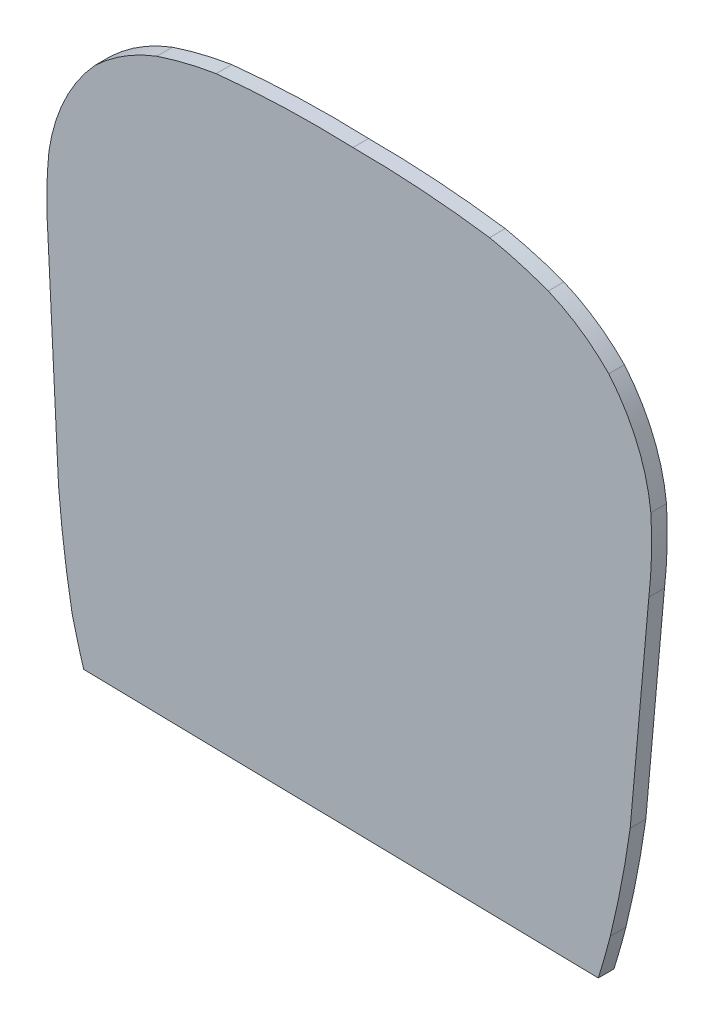
ISO-10303-21;
HEADER;
FILE_DESCRIPTION(('STEP AP214'),'2;1');
FILE_NAME('part.step','',(''),(''),'','','');
FILE_SCHEMA(('AUTOMOTIVE_DESIGN { 1 0 10303 214 1 1 1 1 }'));
ENDSEC;
DATA;
#1=APPLICATION_CONTEXT('core data for automotive mechanical design processes');
#2=APPLICATION_PROTOCOL_DEFINITION('international standard','automotive_design',2000,#1);
#3=PRODUCT_CONTEXT('',#1,'mechanical');
#4=PRODUCT('Part','Part','',(#3));
#5=PRODUCT_RELATED_PRODUCT_CATEGORY('part','',(#4));
#6=PRODUCT_DEFINITION_FORMATION('','',#4);
#7=PRODUCT_DEFINITION_CONTEXT('part definition',#1,'design');
#8=PRODUCT_DEFINITION('design','',#6,#7);
#9=PRODUCT_DEFINITION_SHAPE('','',#8);
#10=(LENGTH_UNIT() NAMED_UNIT(*) SI_UNIT(.MILLI.,.METRE.));
#11=(NAMED_UNIT(*) PLANE_ANGLE_UNIT() SI_UNIT($,.RADIAN.));
#12=(NAMED_UNIT(*) SI_UNIT($,.STERADIAN.) SOLID_ANGLE_UNIT());
#13=UNCERTAINTY_MEASURE_WITH_UNIT(LENGTH_MEASURE(1.E-05),#10,'distance_accuracy_value','');
#14=(GEOMETRIC_REPRESENTATION_CONTEXT(3) GLOBAL_UNCERTAINTY_ASSIGNED_CONTEXT((#13)) GLOBAL_UNIT_ASSIGNED_CONTEXT((#10,
#11,#12)) REPRESENTATION_CONTEXT('',''));
#15=CARTESIAN_POINT('',(0.,0.,0.));
#16=DIRECTION('',(0.,0.,1.));
#17=DIRECTION('',(1.,0.,0.));
#18=AXIS2_PLACEMENT_3D('',#15,#16,#17);
#19=CARTESIAN_POINT('',(-5.67417224383373,6.99934325123754,45.8150965279296));
#20=DIRECTION('',(0.,0.,1.));
#21=DIRECTION('',(-0.999812677663925,0.0193548335692306,0.));
#22=AXIS2_PLACEMENT_3D('',#19,#20,#21);
#23=PLANE('',#22);
#24=CARTESIAN_POINT('',(0.530056286970287,1.01824527478446,45.8150965279299));
#25=DIRECTION('',(0.,0.,-1.));
#26=DIRECTION('',(0.999812677663925,-0.0193548335692306,0.));
#27=AXIS2_PLACEMENT_3D('',#24,#25,#26);
#28=CIRCLE('',#27,12.0325225140272);
#29=CARTESIAN_POINT('',(2.90017532436274,12.8150301672525,45.8150965279298));
#30=VERTEX_POINT('',#29);
#31=CARTESIAN_POINT('',(4.78161682306448,12.2746137415013,45.8150965279299));
#32=VERTEX_POINT('',#31);
#33=EDGE_CURVE('E241',#30,#32,#28,.T.);
#34=ORIENTED_EDGE('',*,*,#33,.F.);
#35=CARTESIAN_POINT('',(-1.48641653317343,-17.9871033769043,45.8150965279301));
#36=DIRECTION('',(0.,0.,-1.));
#37=DIRECTION('',(0.999812677663925,-0.0193548335692306,0.));
#38=AXIS2_PLACEMENT_3D('',#35,#36,#37);
#39=CIRCLE('',#38,31.1129172370042);
#40=CARTESIAN_POINT('',(-1.47338446078643,13.1258111307685,45.8150965279297));
#41=VERTEX_POINT('',#40);
#42=EDGE_CURVE('E237',#41,#30,#39,.T.);
#43=ORIENTED_EDGE('',*,*,#42,.F.);
#44=CARTESIAN_POINT('',(-2.66450711215649,-17.9642973237393,45.8150965279301));
#45=DIRECTION('',(0.,0.,-1.));
#46=DIRECTION('',(0.999812677663925,-0.0193548335692306,0.));
#47=AXIS2_PLACEMENT_3D('',#44,#45,#46);
#48=CIRCLE('',#47,31.1129172030472);
#49=CARTESIAN_POINT('',(-5.85569546522282,12.9845303403083,45.8150965279296));
#50=VERTEX_POINT('',#49);
#51=EDGE_CURVE('E233',#50,#41,#48,.T.);
#52=ORIENTED_EDGE('',*,*,#51,.F.);
#53=CARTESIAN_POINT('',(-3.94391624226271,1.10485449232203,45.8150965279298));
#54=DIRECTION('',(0.,0.,-1.));
#55=DIRECTION('',(0.999812677663925,-0.0193548335692306,0.));
#56=AXIS2_PLACEMENT_3D('',#53,#54,#55);
#57=CIRCLE('',#56,12.0325225140272);
#58=CARTESIAN_POINT('',(-7.75664277320113,12.5173351363735,45.8150965279295));
#59=VERTEX_POINT('',#58);
#60=EDGE_CURVE('E229',#59,#50,#57,.T.);
#61=ORIENTED_EDGE('',*,*,#60,.F.);
#62=CARTESIAN_POINT('',(-5.67417224383373,6.99934325123754,45.8150965279296));
#63=DIRECTION('',(0.,0.,-1.));
#64=DIRECTION('',(0.999812677663925,-0.0193548335692306,0.));
#65=AXIS2_PLACEMENT_3D('',#62,#63,#64);
#66=CIRCLE('',#65,5.8978740195184);
#67=CARTESIAN_POINT('',(-9.74550957704439,11.2665590026749,45.8150965279295));
#68=VERTEX_POINT('',#67);
#69=EDGE_CURVE('E225',#68,#59,#66,.T.);
#70=ORIENTED_EDGE('',*,*,#69,.F.);
#71=CARTESIAN_POINT('',(-5.42512198701847,7.3272075898744,45.8150965279296));
#72=DIRECTION('',(0.,0.,-1.));
#73=DIRECTION('',(0.999812677663925,-0.0193548335692306,0.));
#74=AXIS2_PLACEMENT_3D('',#71,#72,#73);
#75=CIRCLE('',#74,5.846728870196);
#76=CARTESIAN_POINT('',(-11.2152036833306,8.13911425422368,45.8150965279295));
#77=VERTEX_POINT('',#76);
#78=EDGE_CURVE('E221',#77,#68,#75,.T.);
#79=ORIENTED_EDGE('',*,*,#78,.F.);
#80=CARTESIAN_POINT('',(2.30368448001543,6.79226722780302,45.8150965279299));
#81=DIRECTION('',(0.,0.,-1.));
#82=DIRECTION('',(0.999812677663925,-0.0193548335692306,0.));
#83=AXIS2_PLACEMENT_3D('',#80,#81,#82);
#84=CIRCLE('',#83,13.5858137071592);
#85=CARTESIAN_POINT('',(-11.2430688844002,5.76279776767875,45.8150965279295));
#86=VERTEX_POINT('',#85);
#87=EDGE_CURVE('E150',#86,#77,#84,.T.);
#88=ORIENTED_EDGE('',*,*,#87,.F.);
#89=DIRECTION('',(0.0500831809567751,-0.998745050042928,0.));
#90=VECTOR('',#89,1.);
#91=CARTESIAN_POINT('',(-10.9057934577918,-0.963056229434312,45.8150965279296));
#92=LINE('',#91,#90);
#93=CARTESIAN_POINT('',(-10.9057934577918,-0.963056229434231,45.8150965279296));
#94=VERTEX_POINT('',#93);
#95=EDGE_CURVE('E149',#94,#86,#92,.F.);
#96=ORIENTED_EDGE('',*,*,#95,.F.);
#97=CARTESIAN_POINT('',(22.6796627220154,1.7211664776255,45.8150965279306));
#98=DIRECTION('',(0.,0.,-1.));
#99=DIRECTION('',(0.999812677663925,-0.0193548335692306,0.));
#100=AXIS2_PLACEMENT_3D('',#97,#98,#99);
#101=CIRCLE('',#100,33.6925498938096);
#102=CARTESIAN_POINT('',(-10.4707169958812,-4.29882047469555,45.8150965279296));
#103=VERTEX_POINT('',#102);
#104=EDGE_CURVE('E35',#103,#94,#101,.T.);
#105=ORIENTED_EDGE('',*,*,#104,.F.);
#106=CARTESIAN_POINT('',(17.1662588400598,2.46523412556552,45.8150965279304));
#107=DIRECTION('',(0.,0.,-1.));
#108=DIRECTION('',(0.999812677663925,-0.0193548335692306,0.));
#109=AXIS2_PLACEMENT_3D('',#106,#107,#108);
#110=CIRCLE('',#109,28.4526776945808);
#111=CARTESIAN_POINT('',(-10.1003556820076,-5.6641324239686,45.8150965279297));
#112=VERTEX_POINT('',#111);
#113=EDGE_CURVE('E261',#112,#103,#110,.T.);
#114=ORIENTED_EDGE('',*,*,#113,.F.);
#115=DIRECTION('',(0.999812677663925,-0.0193548335692306,0.));
#116=VECTOR('',#115,1.);
#117=CARTESIAN_POINT('',(6.38510731119488,-5.98326559728529,45.8150965279302));
#118=LINE('',#117,#116);
#119=CARTESIAN_POINT('',(6.38510731119487,-5.98326559728529,45.8150965279302));
#120=VERTEX_POINT('',#119);
#121=EDGE_CURVE('E176',#120,#112,#118,.F.);
#122=ORIENTED_EDGE('',*,*,#121,.F.);
#123=CARTESIAN_POINT('',(-20.7843012620732,2.46529083387636,45.8150965279292));
#124=DIRECTION('',(0.,0.,-1.));
#125=DIRECTION('',(0.999812677663925,-0.0193548335692306,0.));
#126=AXIS2_PLACEMENT_3D('',#123,#124,#125);
#127=CIRCLE('',#126,28.4526776945808);
#128=CARTESIAN_POINT('',(6.76871470810026,-4.63303142839532,45.8150965279302));
#129=VERTEX_POINT('',#128);
#130=EDGE_CURVE('E259',#129,#120,#127,.T.);
#131=ORIENTED_EDGE('',*,*,#130,.F.);
#132=CARTESIAN_POINT('',(-25.9566044322497,3.38204221500296,45.8150965279291));
#133=DIRECTION('',(0.,0.,-1.));
#134=DIRECTION('',(0.999812677663925,-0.0193548335692306,0.));
#135=AXIS2_PLACEMENT_3D('',#132,#133,#134);
#136=CIRCLE('',#135,33.6925498938096);
#137=CARTESIAN_POINT('',(7.40687411566913,-1.31542705359407,45.8150965279302));
#138=VERTEX_POINT('',#137);
#139=EDGE_CURVE('E255',#138,#129,#136,.T.);
#140=ORIENTED_EDGE('',*,*,#139,.F.);
#141=DIRECTION('',(0.0886995040357044,0.996058431008854,0.));
#142=VECTOR('',#141,1.);
#143=CARTESIAN_POINT('',(8.00401392218934,5.39020388810814,45.8150965279301));
#144=LINE('',#143,#142);
#145=CARTESIAN_POINT('',(8.00401392218934,5.39020388810806,45.8150965279301));
#146=VERTEX_POINT('',#145);
#147=EDGE_CURVE('E171',#146,#138,#144,.F.);
#148=ORIENTED_EDGE('',*,*,#147,.F.);
#149=CARTESIAN_POINT('',(-5.49274699972552,6.94319413350787,45.8150965279296));
#150=DIRECTION('',(0.,0.,-1.));
#151=DIRECTION('',(0.999812677663925,-0.0193548335692306,0.));
#152=AXIS2_PLACEMENT_3D('',#149,#150,#151);
#153=CIRCLE('',#152,13.5858137071592);
#154=CARTESIAN_POINT('',(8.06813878736105,7.76581844340164,45.8150965279301));
#155=VERTEX_POINT('',#154);
#156=EDGE_CURVE('E253',#155,#146,#153,.T.);
#157=ORIENTED_EDGE('',*,*,#156,.F.);
#158=CARTESIAN_POINT('',(2.25097238178384,7.17861022529906,45.8150965279299));
#159=DIRECTION('',(0.,0.,-1.));
#160=DIRECTION('',(0.999812677663925,-0.0193548335692306,0.));
#161=AXIS2_PLACEMENT_3D('',#158,#159,#160);
#162=CIRCLE('',#161,5.846728870196);
#163=CARTESIAN_POINT('',(6.72058547159109,10.9478007629354,45.81509652793));
#164=VERTEX_POINT('',#163);
#165=EDGE_CURVE('E249',#164,#155,#162,.T.);
#166=ORIENTED_EDGE('',*,*,#165,.F.);
#167=CARTESIAN_POINT('',(2.48714690336352,6.84135268227571,45.8150965279299));
#168=DIRECTION('',(0.,0.,-1.));
#169=DIRECTION('',(0.999812677663925,-0.0193548335692306,0.));
#170=AXIS2_PLACEMENT_3D('',#167,#168,#169);
#171=CIRCLE('',#170,5.8978740195184);
#172=EDGE_CURVE('E245',#32,#164,#171,.T.);
#173=ORIENTED_EDGE('',*,*,#172,.F.);
#174=EDGE_LOOP('',(#34,#43,#52,#61,#70,#79,#88,#96,#105,#114,#122,#131,#140,#148,#157,#166,#173));
#175=FACE_BOUND('',#174,.T.);
#176=ADVANCED_FACE('F32',(#175),#23,.T.);
#177=CARTESIAN_POINT('',(-10.9057934577918,-0.963056229434297,46.8472492910314));
#178=DIRECTION('',(-0.998745050042928,-0.0500831809567751,0.));
#179=DIRECTION('',(0.0500831809567751,-0.998745050042928,0.));
#180=AXIS2_PLACEMENT_3D('',#177,#178,#179);
#181=PLANE('',#180);
#182=DIRECTION('',(0.,0.,-1.));
#183=VECTOR('',#182,1.);
#184=CARTESIAN_POINT('',(-10.9057934577918,-0.963056229434226,46.8472492910314));
#185=LINE('',#184,#183);
#186=CARTESIAN_POINT('',(-10.9057934577918,-0.963056229434252,45.3140965279296));
#187=VERTEX_POINT('',#186);
#188=EDGE_CURVE('E155',#94,#187,#185,.T.);
#189=ORIENTED_EDGE('',*,*,#188,.F.);
#190=ORIENTED_EDGE('',*,*,#95,.T.);
#191=DIRECTION('',(0.,0.,-1.));
#192=VECTOR('',#191,1.);
#193=CARTESIAN_POINT('',(-11.2430688844002,5.76279776767878,46.8472492910314));
#194=LINE('',#193,#192);
#195=CARTESIAN_POINT('',(-11.2430688844002,5.76279776767882,45.3140965279295));
#196=VERTEX_POINT('',#195);
#197=EDGE_CURVE('E220',#196,#86,#194,.F.);
#198=ORIENTED_EDGE('',*,*,#197,.F.);
#199=DIRECTION('',(0.050083180956776,-0.998745050042928,0.));
#200=VECTOR('',#199,1.);
#201=CARTESIAN_POINT('',(-11.2430688844002,5.76279776767876,45.3140965279295));
#202=LINE('',#201,#200);
#203=EDGE_CURVE('E166',#196,#187,#202,.T.);
#204=ORIENTED_EDGE('',*,*,#203,.T.);
#205=EDGE_LOOP('',(#189,#190,#198,#204));
#206=FACE_BOUND('',#205,.T.);
#207=ADVANCED_FACE('F164',(#206),#181,.T.);
#208=CARTESIAN_POINT('',(22.6796627220154,1.72116647762551,46.8472492910325));
#209=DIRECTION('',(0.,0.,-1.));
#210=DIRECTION('',(0.999812677663925,-0.0193548335692306,0.));
#211=AXIS2_PLACEMENT_3D('',#208,#209,#210);
#212=CYLINDRICAL_SURFACE('',#211,33.6925498938096);
#213=DIRECTION('',(0.,0.,-1.));
#214=VECTOR('',#213,1.);
#215=CARTESIAN_POINT('',(-10.4707169958812,-4.29882047469553,46.8472492910315));
#216=LINE('',#215,#214);
#217=CARTESIAN_POINT('',(-10.4707169958812,-4.29882047469555,45.3140965279297));
#218=VERTEX_POINT('',#217);
#219=EDGE_CURVE('E162',#103,#218,#216,.T.);
#220=ORIENTED_EDGE('',*,*,#219,.F.);
#221=ORIENTED_EDGE('',*,*,#104,.T.);
#222=ORIENTED_EDGE('',*,*,#188,.T.);
#223=CARTESIAN_POINT('',(22.6796627220154,1.72116647762549,45.3140965279306));
#224=DIRECTION('',(0.,0.,-1.));
#225=DIRECTION('',(0.999812677663925,-0.0193548335692306,0.));
#226=AXIS2_PLACEMENT_3D('',#223,#224,#225);
#227=CIRCLE('',#226,33.6925498938096);
#228=EDGE_CURVE('E217',#187,#218,#227,.F.);
#229=ORIENTED_EDGE('',*,*,#228,.T.);
#230=EDGE_LOOP('',(#220,#221,#222,#229));
#231=FACE_BOUND('',#230,.T.);
#232=ADVANCED_FACE('F159',(#231),#212,.T.);
#233=CARTESIAN_POINT('',(17.1662588400597,2.46523412556554,46.8472492910323));
#234=DIRECTION('',(0.,0.,-1.));
#235=DIRECTION('',(0.999812677663925,-0.0193548335692306,0.));
#236=AXIS2_PLACEMENT_3D('',#233,#234,#235);
#237=CYLINDRICAL_SURFACE('',#236,28.4526776945808);
#238=DIRECTION('',(0.,0.,1.));
#239=VECTOR('',#238,1.);
#240=CARTESIAN_POINT('',(-10.1003556820076,-5.66413242396858,46.8472492910315));
#241=LINE('',#240,#239);
#242=CARTESIAN_POINT('',(-10.1003556820075,-5.66413242396861,45.3140965279297));
#243=VERTEX_POINT('',#242);
#244=EDGE_CURVE('E179',#112,#243,#241,.F.);
#245=ORIENTED_EDGE('',*,*,#244,.F.);
#246=ORIENTED_EDGE('',*,*,#113,.T.);
#247=ORIENTED_EDGE('',*,*,#219,.T.);
#248=CARTESIAN_POINT('',(17.1662588400598,2.46523412556551,45.3140965279305));
#249=DIRECTION('',(0.,0.,-1.));
#250=DIRECTION('',(0.999812677663925,-0.0193548335692306,0.));
#251=AXIS2_PLACEMENT_3D('',#248,#249,#250);
#252=CIRCLE('',#251,28.4526776945808);
#253=EDGE_CURVE('E214',#218,#243,#252,.F.);
#254=ORIENTED_EDGE('',*,*,#253,.T.);
#255=EDGE_LOOP('',(#245,#246,#247,#254));
#256=FACE_BOUND('',#255,.T.);
#257=ADVANCED_FACE('F265',(#256),#237,.T.);
#258=CARTESIAN_POINT('',(6.38510731119485,-5.98326559728527,46.8472492910321));
#259=DIRECTION('',(-0.0193548335692306,-0.999812677663925,0.));
#260=DIRECTION('',(0.999812677663925,-0.0193548335692306,0.));
#261=AXIS2_PLACEMENT_3D('',#258,#259,#260);
#262=PLANE('',#261);
#263=DIRECTION('',(0.,0.,-1.));
#264=VECTOR('',#263,1.);
#265=CARTESIAN_POINT('',(6.38510731119484,-5.98326559728527,46.8472492910321));
#266=LINE('',#265,#264);
#267=CARTESIAN_POINT('',(6.38510731119489,-5.98326559728529,45.3140965279302));
#268=VERTEX_POINT('',#267);
#269=EDGE_CURVE('E178',#120,#268,#266,.T.);
#270=ORIENTED_EDGE('',*,*,#269,.F.);
#271=ORIENTED_EDGE('',*,*,#121,.T.);
#272=ORIENTED_EDGE('',*,*,#244,.T.);
#273=DIRECTION('',(-0.999812677663925,0.0193548335692306,0.));
#274=VECTOR('',#273,1.);
#275=CARTESIAN_POINT('',(-2.42926960316287,-5.81263283576393,45.3140965279299));
#276=LINE('',#275,#274);
#277=EDGE_CURVE('E213',#243,#268,#276,.F.);
#278=ORIENTED_EDGE('',*,*,#277,.T.);
#279=EDGE_LOOP('',(#270,#271,#272,#278));
#280=FACE_BOUND('',#279,.T.);
#281=ADVANCED_FACE('F296',(#280),#262,.T.);
#282=CARTESIAN_POINT('',(-20.7843012620732,2.46529083387637,46.8472492910311));
#283=DIRECTION('',(0.,0.,-1.));
#284=DIRECTION('',(0.999812677663925,-0.0193548335692306,0.));
#285=AXIS2_PLACEMENT_3D('',#282,#283,#284);
#286=CYLINDRICAL_SURFACE('',#285,28.4526776945808);
#287=DIRECTION('',(0.,0.,-1.));
#288=VECTOR('',#287,1.);
#289=CARTESIAN_POINT('',(6.76871470810022,-4.63303142839535,46.8472492910321));
#290=LINE('',#289,#288);
#291=CARTESIAN_POINT('',(6.76871470810029,-4.63303142839528,45.3140965279302));
#292=VERTEX_POINT('',#291);
#293=EDGE_CURVE('E258',#129,#292,#290,.T.);
#294=ORIENTED_EDGE('',*,*,#293,.F.);
#295=ORIENTED_EDGE('',*,*,#130,.T.);
#296=ORIENTED_EDGE('',*,*,#269,.T.);
#297=CARTESIAN_POINT('',(-20.7843012620732,2.46529083387635,45.3140965279292));
#298=DIRECTION('',(0.,0.,-1.));
#299=DIRECTION('',(0.999812677663925,-0.0193548335692306,0.));
#300=AXIS2_PLACEMENT_3D('',#297,#298,#299);
#301=CIRCLE('',#300,28.4526776945808);
#302=EDGE_CURVE('E210',#268,#292,#301,.F.);
#303=ORIENTED_EDGE('',*,*,#302,.T.);
#304=EDGE_LOOP('',(#294,#295,#296,#303));
#305=FACE_BOUND('',#304,.T.);
#306=ADVANCED_FACE('F295',(#305),#286,.T.);
#307=CARTESIAN_POINT('',(-25.9566044322497,3.38204221500297,46.8472492910309));
#308=DIRECTION('',(0.,0.,-1.));
#309=DIRECTION('',(0.999812677663925,-0.0193548335692306,0.));
#310=AXIS2_PLACEMENT_3D('',#307,#308,#309);
#311=CYLINDRICAL_SURFACE('',#310,33.6925498938096);
#312=DIRECTION('',(0.,0.,1.));
#313=VECTOR('',#312,1.);
#314=CARTESIAN_POINT('',(7.40687411566909,-1.31542705359407,46.847249291032));
#315=LINE('',#314,#313);
#316=CARTESIAN_POINT('',(7.40687411566913,-1.31542705359414,45.3140965279302));
#317=VERTEX_POINT('',#316);
#318=EDGE_CURVE('E175',#138,#317,#315,.F.);
#319=ORIENTED_EDGE('',*,*,#318,.F.);
#320=ORIENTED_EDGE('',*,*,#139,.T.);
#321=ORIENTED_EDGE('',*,*,#293,.T.);
#322=CARTESIAN_POINT('',(-25.9566044322497,3.38204221500295,45.3140965279291));
#323=DIRECTION('',(0.,0.,-1.));
#324=DIRECTION('',(0.999812677663925,-0.0193548335692306,0.));
#325=AXIS2_PLACEMENT_3D('',#322,#323,#324);
#326=CIRCLE('',#325,33.6925498938096);
#327=EDGE_CURVE('E207',#292,#317,#326,.F.);
#328=ORIENTED_EDGE('',*,*,#327,.T.);
#329=EDGE_LOOP('',(#319,#320,#321,#328));
#330=FACE_BOUND('',#329,.T.);
#331=ADVANCED_FACE('F300',(#330),#311,.T.);
#332=CARTESIAN_POINT('',(8.00401392218931,5.39020388810815,46.847249291032));
#333=DIRECTION('',(0.996058431008854,-0.0886995040357044,0.));
#334=DIRECTION('',(0.0886995040357044,0.996058431008854,0.));
#335=AXIS2_PLACEMENT_3D('',#332,#333,#334);
#336=PLANE('',#335);
#337=DIRECTION('',(0.,0.,-1.));
#338=VECTOR('',#337,1.);
#339=CARTESIAN_POINT('',(8.00401392218931,5.39020388810814,46.847249291032));
#340=LINE('',#339,#338);
#341=CARTESIAN_POINT('',(8.00401392218936,5.3902038881081,45.3140965279301));
#342=VERTEX_POINT('',#341);
#343=EDGE_CURVE('E174',#146,#342,#340,.T.);
#344=ORIENTED_EDGE('',*,*,#343,.F.);
#345=ORIENTED_EDGE('',*,*,#147,.T.);
#346=ORIENTED_EDGE('',*,*,#318,.T.);
#347=DIRECTION('',(0.0886995040357049,0.996058431008854,0.));
#348=VECTOR('',#347,1.);
#349=CARTESIAN_POINT('',(7.40687411566913,-1.31542705359416,45.3140965279302));
#350=LINE('',#349,#348);
#351=EDGE_CURVE('E206',#317,#342,#350,.T.);
#352=ORIENTED_EDGE('',*,*,#351,.T.);
#353=EDGE_LOOP('',(#344,#345,#346,#352));
#354=FACE_BOUND('',#353,.T.);
#355=ADVANCED_FACE('F305',(#354),#336,.T.);
#356=CARTESIAN_POINT('',(-5.49274699972555,6.94319413350788,46.8472492910315));
#357=DIRECTION('',(0.,0.,-1.));
#358=DIRECTION('',(0.999812677663925,-0.0193548335692306,0.));
#359=AXIS2_PLACEMENT_3D('',#356,#357,#358);
#360=CYLINDRICAL_SURFACE('',#359,13.5858137071592);
#361=CARTESIAN_POINT('',(-5.4927469997255,6.94319413350786,45.3140965279297));
#362=DIRECTION('',(0.,0.,-1.));
#363=DIRECTION('',(0.999812677663925,-0.0193548335692306,0.));
#364=AXIS2_PLACEMENT_3D('',#361,#362,#363);
#365=CIRCLE('',#364,13.5858137071592);
#366=CARTESIAN_POINT('',(8.06813878736107,7.76581844340164,45.3140965279301));
#367=VERTEX_POINT('',#366);
#368=EDGE_CURVE('E204',#342,#367,#365,.F.);
#369=ORIENTED_EDGE('',*,*,#368,.T.);
#370=DIRECTION('',(0.,0.,-1.));
#371=VECTOR('',#370,1.);
#372=CARTESIAN_POINT('',(8.06813878736102,7.76581844340167,46.8472492910319));
#373=LINE('',#372,#371);
#374=EDGE_CURVE('E252',#155,#367,#373,.T.);
#375=ORIENTED_EDGE('',*,*,#374,.F.);
#376=ORIENTED_EDGE('',*,*,#156,.T.);
#377=ORIENTED_EDGE('',*,*,#343,.T.);
#378=EDGE_LOOP('',(#369,#375,#376,#377));
#379=FACE_BOUND('',#378,.T.);
#380=ADVANCED_FACE('F311',(#379),#360,.T.);
#381=CARTESIAN_POINT('',(2.2509723817838,7.17861022529908,46.8472492910318));
#382=DIRECTION('',(0.,0.,-1.));
#383=DIRECTION('',(0.999812677663925,-0.0193548335692306,0.));
#384=AXIS2_PLACEMENT_3D('',#381,#382,#383);
#385=CYLINDRICAL_SURFACE('',#384,5.846728870196);
#386=DIRECTION('',(0.,0.,-1.));
#387=VECTOR('',#386,1.);
#388=CARTESIAN_POINT('',(6.72058547159106,10.9478007629354,46.8472492910318));
#389=LINE('',#388,#387);
#390=CARTESIAN_POINT('',(6.72058547159111,10.9478007629353,45.31409652793));
#391=VERTEX_POINT('',#390);
#392=EDGE_CURVE('E248',#164,#391,#389,.T.);
#393=ORIENTED_EDGE('',*,*,#392,.F.);
#394=ORIENTED_EDGE('',*,*,#165,.T.);
#395=ORIENTED_EDGE('',*,*,#374,.T.);
#396=CARTESIAN_POINT('',(2.25097238178385,7.17861022529905,45.3140965279299));
#397=DIRECTION('',(0.,0.,-1.));
#398=DIRECTION('',(0.999812677663925,-0.0193548335692306,0.));
#399=AXIS2_PLACEMENT_3D('',#396,#397,#398);
#400=CIRCLE('',#399,5.846728870196);
#401=EDGE_CURVE('E201',#367,#391,#400,.F.);
#402=ORIENTED_EDGE('',*,*,#401,.T.);
#403=EDGE_LOOP('',(#393,#394,#395,#402));
#404=FACE_BOUND('',#403,.T.);
#405=ADVANCED_FACE('F314',(#404),#385,.T.);
#406=CARTESIAN_POINT('',(2.48714690336348,6.84135268227572,46.8472492910318));
#407=DIRECTION('',(0.,0.,-1.));
#408=DIRECTION('',(0.999812677663925,-0.0193548335692306,0.));
#409=AXIS2_PLACEMENT_3D('',#406,#407,#408);
#410=CYLINDRICAL_SURFACE('',#409,5.8978740195184);
#411=DIRECTION('',(0.,0.,-1.));
#412=VECTOR('',#411,1.);
#413=CARTESIAN_POINT('',(4.78161682306445,12.2746137415013,46.8472492910318));
#414=LINE('',#413,#412);
#415=CARTESIAN_POINT('',(4.78161682306451,12.2746137415013,45.3140965279299));
#416=VERTEX_POINT('',#415);
#417=EDGE_CURVE('E244',#32,#416,#414,.T.);
#418=ORIENTED_EDGE('',*,*,#417,.F.);
#419=ORIENTED_EDGE('',*,*,#172,.T.);
#420=ORIENTED_EDGE('',*,*,#392,.T.);
#421=CARTESIAN_POINT('',(2.48714690336353,6.8413526822757,45.3140965279299));
#422=DIRECTION('',(0.,0.,-1.));
#423=DIRECTION('',(0.999812677663925,-0.0193548335692306,0.));
#424=AXIS2_PLACEMENT_3D('',#421,#422,#423);
#425=CIRCLE('',#424,5.8978740195184);
#426=EDGE_CURVE('E198',#391,#416,#425,.F.);
#427=ORIENTED_EDGE('',*,*,#426,.T.);
#428=EDGE_LOOP('',(#418,#419,#420,#427));
#429=FACE_BOUND('',#428,.T.);
#430=ADVANCED_FACE('F317',(#429),#410,.T.);
#431=CARTESIAN_POINT('',(0.530056286970254,1.01824527478447,46.8472492910318));
#432=DIRECTION('',(0.,0.,-1.));
#433=DIRECTION('',(0.999812677663925,-0.0193548335692306,0.));
#434=AXIS2_PLACEMENT_3D('',#431,#432,#433);
#435=CYLINDRICAL_SURFACE('',#434,12.0325225140272);
#436=DIRECTION('',(0.,0.,-1.));
#437=VECTOR('',#436,1.);
#438=CARTESIAN_POINT('',(2.90017532436272,12.8150301672525,46.8472492910317));
#439=LINE('',#438,#437);
#440=CARTESIAN_POINT('',(2.90017532436274,12.8150301672525,45.3140965279298));
#441=VERTEX_POINT('',#440);
#442=EDGE_CURVE('E240',#30,#441,#439,.T.);
#443=ORIENTED_EDGE('',*,*,#442,.F.);
#444=ORIENTED_EDGE('',*,*,#33,.T.);
#445=ORIENTED_EDGE('',*,*,#417,.T.);
#446=CARTESIAN_POINT('',(0.530056286970303,1.01824527478445,45.3140965279299));
#447=DIRECTION('',(0.,0.,-1.));
#448=DIRECTION('',(0.999812677663925,-0.0193548335692306,0.));
#449=AXIS2_PLACEMENT_3D('',#446,#447,#448);
#450=CIRCLE('',#449,12.0325225140272);
#451=EDGE_CURVE('E195',#416,#441,#450,.F.);
#452=ORIENTED_EDGE('',*,*,#451,.T.);
#453=EDGE_LOOP('',(#443,#444,#445,#452));
#454=FACE_BOUND('',#453,.T.);
#455=ADVANCED_FACE('F321',(#454),#435,.T.);
#456=CARTESIAN_POINT('',(-1.48641653317347,-17.9871033769043,46.847249291032));
#457=DIRECTION('',(0.,0.,-1.));
#458=DIRECTION('',(0.999812677663925,-0.0193548335692306,0.));
#459=AXIS2_PLACEMENT_3D('',#456,#457,#458);
#460=CYLINDRICAL_SURFACE('',#459,31.1129172370042);
#461=DIRECTION('',(0.,0.,-1.));
#462=VECTOR('',#461,1.);
#463=CARTESIAN_POINT('',(-1.47338446078647,13.1258111307686,46.8472492910316));
#464=LINE('',#463,#462);
#465=CARTESIAN_POINT('',(-1.47338446078642,13.1258111307685,45.3140965279297));
#466=VERTEX_POINT('',#465);
#467=EDGE_CURVE('E236',#41,#466,#464,.T.);
#468=ORIENTED_EDGE('',*,*,#467,.F.);
#469=ORIENTED_EDGE('',*,*,#42,.T.);
#470=ORIENTED_EDGE('',*,*,#442,.T.);
#471=CARTESIAN_POINT('',(-1.48641653317342,-17.9871033769043,45.3140965279301));
#472=DIRECTION('',(0.,0.,-1.));
#473=DIRECTION('',(0.999812677663925,-0.0193548335692306,0.));
#474=AXIS2_PLACEMENT_3D('',#471,#472,#473);
#475=CIRCLE('',#474,31.1129172370042);
#476=EDGE_CURVE('E192',#441,#466,#475,.F.);
#477=ORIENTED_EDGE('',*,*,#476,.T.);
#478=EDGE_LOOP('',(#468,#469,#470,#477));
#479=FACE_BOUND('',#478,.T.);
#480=ADVANCED_FACE('F327',(#479),#460,.T.);
#481=CARTESIAN_POINT('',(-2.66450711215652,-17.9642973237393,46.8472492910319));
#482=DIRECTION('',(0.,0.,-1.));
#483=DIRECTION('',(0.999812677663925,-0.0193548335692306,0.));
#484=AXIS2_PLACEMENT_3D('',#481,#482,#483);
#485=CYLINDRICAL_SURFACE('',#484,31.1129172030472);
#486=DIRECTION('',(0.,0.,-1.));
#487=VECTOR('',#486,1.);
#488=CARTESIAN_POINT('',(-5.85569546522287,12.9845303403084,46.8472492910314));
#489=LINE('',#488,#487);
#490=CARTESIAN_POINT('',(-5.85569546522282,12.9845303403083,45.3140965279296));
#491=VERTEX_POINT('',#490);
#492=EDGE_CURVE('E232',#50,#491,#489,.T.);
#493=ORIENTED_EDGE('',*,*,#492,.F.);
#494=ORIENTED_EDGE('',*,*,#51,.T.);
#495=ORIENTED_EDGE('',*,*,#467,.T.);
#496=CARTESIAN_POINT('',(-2.66450711215648,-17.9642973237393,45.3140965279301));
#497=DIRECTION('',(0.,0.,-1.));
#498=DIRECTION('',(0.999812677663925,-0.0193548335692306,0.));
#499=AXIS2_PLACEMENT_3D('',#496,#497,#498);
#500=CIRCLE('',#499,31.1129172030472);
#501=EDGE_CURVE('E189',#466,#491,#500,.F.);
#502=ORIENTED_EDGE('',*,*,#501,.T.);
#503=EDGE_LOOP('',(#493,#494,#495,#502));
#504=FACE_BOUND('',#503,.T.);
#505=ADVANCED_FACE('F330',(#504),#485,.T.);
#506=CARTESIAN_POINT('',(-3.94391624226274,1.10485449232204,46.8472492910316));
#507=DIRECTION('',(0.,0.,-1.));
#508=DIRECTION('',(0.999812677663925,-0.0193548335692306,0.));
#509=AXIS2_PLACEMENT_3D('',#506,#507,#508);
#510=CYLINDRICAL_SURFACE('',#509,12.0325225140272);
#511=DIRECTION('',(0.,0.,-1.));
#512=VECTOR('',#511,1.);
#513=CARTESIAN_POINT('',(-7.75664277320116,12.5173351363735,46.8472492910314));
#514=LINE('',#513,#512);
#515=CARTESIAN_POINT('',(-7.75664277320111,12.5173351363735,45.3140965279295));
#516=VERTEX_POINT('',#515);
#517=EDGE_CURVE('E228',#59,#516,#514,.T.);
#518=ORIENTED_EDGE('',*,*,#517,.F.);
#519=ORIENTED_EDGE('',*,*,#60,.T.);
#520=ORIENTED_EDGE('',*,*,#492,.T.);
#521=CARTESIAN_POINT('',(-3.9439162422627,1.10485449232202,45.3140965279298));
#522=DIRECTION('',(0.,0.,-1.));
#523=DIRECTION('',(0.999812677663925,-0.0193548335692306,0.));
#524=AXIS2_PLACEMENT_3D('',#521,#522,#523);
#525=CIRCLE('',#524,12.0325225140272);
#526=EDGE_CURVE('E186',#491,#516,#525,.F.);
#527=ORIENTED_EDGE('',*,*,#526,.T.);
#528=EDGE_LOOP('',(#518,#519,#520,#527));
#529=FACE_BOUND('',#528,.T.);
#530=ADVANCED_FACE('F333',(#529),#510,.T.);
#531=CARTESIAN_POINT('',(-5.67417224383376,6.99934325123756,46.8472492910315));
#532=DIRECTION('',(0.,0.,-1.));
#533=DIRECTION('',(0.999812677663925,-0.0193548335692306,0.));
#534=AXIS2_PLACEMENT_3D('',#531,#532,#533);
#535=CYLINDRICAL_SURFACE('',#534,5.8978740195184);
#536=DIRECTION('',(0.,0.,-1.));
#537=VECTOR('',#536,1.);
#538=CARTESIAN_POINT('',(-9.74550957704442,11.2665590026749,46.8472492910313));
#539=LINE('',#538,#537);
#540=CARTESIAN_POINT('',(-9.74550957704437,11.2665590026749,45.3140965279295));
#541=VERTEX_POINT('',#540);
#542=EDGE_CURVE('E224',#68,#541,#539,.T.);
#543=ORIENTED_EDGE('',*,*,#542,.F.);
#544=ORIENTED_EDGE('',*,*,#69,.T.);
#545=ORIENTED_EDGE('',*,*,#517,.T.);
#546=CARTESIAN_POINT('',(-5.67417224383371,6.99934325123754,45.3140965279296));
#547=DIRECTION('',(0.,0.,-1.));
#548=DIRECTION('',(0.999812677663925,-0.0193548335692306,0.));
#549=AXIS2_PLACEMENT_3D('',#546,#547,#548);
#550=CIRCLE('',#549,5.8978740195184);
#551=EDGE_CURVE('E183',#516,#541,#550,.F.);
#552=ORIENTED_EDGE('',*,*,#551,.T.);
#553=EDGE_LOOP('',(#543,#544,#545,#552));
#554=FACE_BOUND('',#553,.T.);
#555=ADVANCED_FACE('F337',(#554),#535,.T.);
#556=CARTESIAN_POINT('',(-5.4251219870185,7.32720758987442,46.8472492910315));
#557=DIRECTION('',(0.,0.,-1.));
#558=DIRECTION('',(0.999812677663925,-0.0193548335692306,0.));
#559=AXIS2_PLACEMENT_3D('',#556,#557,#558);
#560=CYLINDRICAL_SURFACE('',#559,5.846728870196);
#561=DIRECTION('',(0.,0.,-1.));
#562=VECTOR('',#561,1.);
#563=CARTESIAN_POINT('',(-11.2152036833306,8.13911425422368,46.8472492910313));
#564=LINE('',#563,#562);
#565=CARTESIAN_POINT('',(-11.2152036833306,8.13911425422366,45.3140965279295));
#566=VERTEX_POINT('',#565);
#567=EDGE_CURVE('E49',#77,#566,#564,.T.);
#568=ORIENTED_EDGE('',*,*,#567,.F.);
#569=ORIENTED_EDGE('',*,*,#78,.T.);
#570=ORIENTED_EDGE('',*,*,#542,.T.);
#571=CARTESIAN_POINT('',(-5.42512198701845,7.3272075898744,45.3140965279296));
#572=DIRECTION('',(0.,0.,-1.));
#573=DIRECTION('',(0.999812677663925,-0.0193548335692306,0.));
#574=AXIS2_PLACEMENT_3D('',#571,#572,#573);
#575=CIRCLE('',#574,5.846728870196);
#576=EDGE_CURVE('E41',#541,#566,#575,.F.);
#577=ORIENTED_EDGE('',*,*,#576,.T.);
#578=EDGE_LOOP('',(#568,#569,#570,#577));
#579=FACE_BOUND('',#578,.T.);
#580=ADVANCED_FACE('F339',(#579),#560,.T.);
#581=CARTESIAN_POINT('',(2.30368448001539,6.79226722780303,46.8472492910318));
#582=DIRECTION('',(0.,0.,-1.));
#583=DIRECTION('',(0.999812677663925,-0.0193548335692306,0.));
#584=AXIS2_PLACEMENT_3D('',#581,#582,#583);
#585=CYLINDRICAL_SURFACE('',#584,13.5858137071592);
#586=ORIENTED_EDGE('',*,*,#197,.T.);
#587=ORIENTED_EDGE('',*,*,#87,.T.);
#588=ORIENTED_EDGE('',*,*,#567,.T.);
#589=CARTESIAN_POINT('',(2.30368448001544,6.79226722780301,45.3140965279299));
#590=DIRECTION('',(0.,0.,-1.));
#591=DIRECTION('',(0.999812677663925,-0.0193548335692306,0.));
#592=AXIS2_PLACEMENT_3D('',#589,#590,#591);
#593=CIRCLE('',#592,13.5858137071592);
#594=EDGE_CURVE('E11',#566,#196,#593,.F.);
#595=ORIENTED_EDGE('',*,*,#594,.T.);
#596=EDGE_LOOP('',(#586,#587,#588,#595));
#597=FACE_BOUND('',#596,.T.);
#598=ADVANCED_FACE('F341',(#597),#585,.T.);
#599=CARTESIAN_POINT('',(-2.66450711215648,-17.9642973237393,45.3140965279301));
#600=DIRECTION('',(0.,0.,1.));
#601=DIRECTION('',(-0.999812677663925,0.0193548335692306,0.));
#602=AXIS2_PLACEMENT_3D('',#599,#600,#601);
#603=PLANE('',#602);
#604=ORIENTED_EDGE('',*,*,#576,.F.);
#605=ORIENTED_EDGE('',*,*,#551,.F.);
#606=ORIENTED_EDGE('',*,*,#526,.F.);
#607=ORIENTED_EDGE('',*,*,#501,.F.);
#608=ORIENTED_EDGE('',*,*,#476,.F.);
#609=ORIENTED_EDGE('',*,*,#451,.F.);
#610=ORIENTED_EDGE('',*,*,#426,.F.);
#611=ORIENTED_EDGE('',*,*,#401,.F.);
#612=ORIENTED_EDGE('',*,*,#368,.F.);
#613=ORIENTED_EDGE('',*,*,#351,.F.);
#614=ORIENTED_EDGE('',*,*,#327,.F.);
#615=ORIENTED_EDGE('',*,*,#302,.F.);
#616=ORIENTED_EDGE('',*,*,#277,.F.);
#617=ORIENTED_EDGE('',*,*,#253,.F.);
#618=ORIENTED_EDGE('',*,*,#228,.F.);
#619=ORIENTED_EDGE('',*,*,#203,.F.);
#620=ORIENTED_EDGE('',*,*,#594,.F.);
#621=EDGE_LOOP('',(#604,#605,#606,#607,#608,#609,#610,#611,#612,#613,#614,#615,#616,#617,#618,
#619,#620));
#622=FACE_BOUND('',#621,.T.);
#623=ADVANCED_FACE('F269',(#622),#603,.F.);
#624=CLOSED_SHELL('',(#176,#207,#232,#257,#281,#306,#331,#355,#380,#405,#430,#455,#480,#505,
#530,#555,#580,#598,#623));
#625=MANIFOLD_SOLID_BREP('B2',#624);
#626=ADVANCED_BREP_SHAPE_REPRESENTATION('',(#18,#625),#14);
#627=SHAPE_DEFINITION_REPRESENTATION(#9,#626);
ENDSEC;
END-ISO-10303-21;
